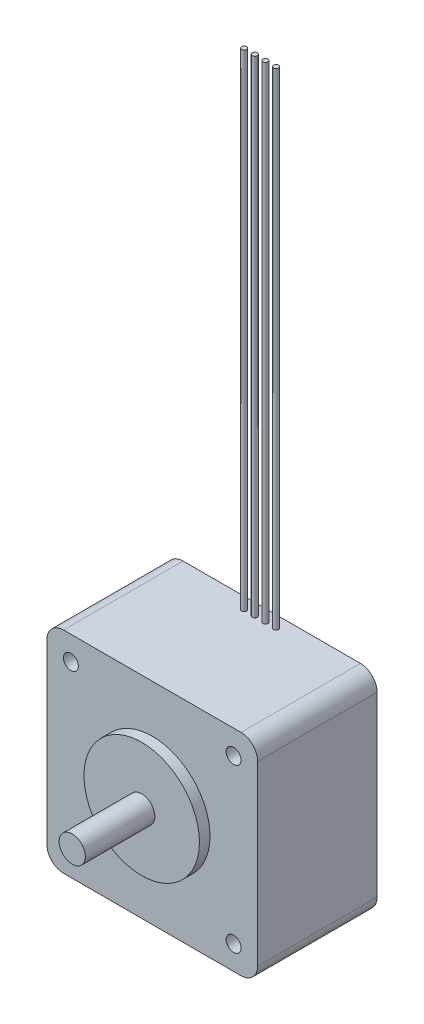
ISO-10303-21;
HEADER;
FILE_DESCRIPTION(('STEP AP214'),'2;1');
FILE_NAME('part.step','',(''),(''),'','','');
FILE_SCHEMA(('AUTOMOTIVE_DESIGN { 1 0 10303 214 1 1 1 1 }'));
ENDSEC;
DATA;
#1=APPLICATION_CONTEXT('core data for automotive mechanical design processes');
#2=APPLICATION_PROTOCOL_DEFINITION('international standard','automotive_design',2000,#1);
#3=PRODUCT_CONTEXT('',#1,'mechanical');
#4=PRODUCT('Part','Part','',(#3));
#5=PRODUCT_RELATED_PRODUCT_CATEGORY('part','',(#4));
#6=PRODUCT_DEFINITION_FORMATION('','',#4);
#7=PRODUCT_DEFINITION_CONTEXT('part definition',#1,'design');
#8=PRODUCT_DEFINITION('design','',#6,#7);
#9=PRODUCT_DEFINITION_SHAPE('','',#8);
#10=(LENGTH_UNIT() NAMED_UNIT(*) SI_UNIT(.MILLI.,.METRE.));
#11=(NAMED_UNIT(*) PLANE_ANGLE_UNIT() SI_UNIT($,.RADIAN.));
#12=(NAMED_UNIT(*) SI_UNIT($,.STERADIAN.) SOLID_ANGLE_UNIT());
#13=UNCERTAINTY_MEASURE_WITH_UNIT(LENGTH_MEASURE(1.E-05),#10,'distance_accuracy_value','');
#14=(GEOMETRIC_REPRESENTATION_CONTEXT(3) GLOBAL_UNCERTAINTY_ASSIGNED_CONTEXT((#13)) GLOBAL_UNIT_ASSIGNED_CONTEXT((#10,
#11,#12)) REPRESENTATION_CONTEXT('',''));
#15=CARTESIAN_POINT('',(0.,0.,0.));
#16=DIRECTION('',(0.,0.,1.));
#17=DIRECTION('',(1.,0.,0.));
#18=AXIS2_PLACEMENT_3D('',#15,#16,#17);
#19=CARTESIAN_POINT('',(-20.066,-20.066,0.));
#20=DIRECTION('',(0.,-1.,0.));
#21=DIRECTION('',(0.,0.,-1.));
#22=AXIS2_PLACEMENT_3D('',#19,#20,#21);
#23=PLANE('',#22);
#24=DIRECTION('',(1.,0.,0.));
#25=VECTOR('',#24,1.);
#26=CARTESIAN_POINT('',(-20.066,-20.066,22.7584));
#27=LINE('',#26,#25);
#28=CARTESIAN_POINT('',(-16.891,-20.066,22.7584));
#29=VERTEX_POINT('',#28);
#30=CARTESIAN_POINT('',(16.891,-20.066,22.7584));
#31=VERTEX_POINT('',#30);
#32=EDGE_CURVE('E94',#29,#31,#27,.T.);
#33=ORIENTED_EDGE('',*,*,#32,.F.);
#34=DIRECTION('',(0.,0.,1.));
#35=VECTOR('',#34,1.);
#36=CARTESIAN_POINT('',(-16.891,-20.066,0.));
#37=LINE('',#36,#35);
#38=CARTESIAN_POINT('',(-16.891,-20.066,0.));
#39=VERTEX_POINT('',#38);
#40=EDGE_CURVE('E133',#29,#39,#37,.F.);
#41=ORIENTED_EDGE('',*,*,#40,.T.);
#42=DIRECTION('',(1.,0.,0.));
#43=VECTOR('',#42,1.);
#44=CARTESIAN_POINT('',(-20.066,-20.066,0.));
#45=LINE('',#44,#43);
#46=CARTESIAN_POINT('',(16.891,-20.066,0.));
#47=VERTEX_POINT('',#46);
#48=EDGE_CURVE('E117',#39,#47,#45,.T.);
#49=ORIENTED_EDGE('',*,*,#48,.T.);
#50=DIRECTION('',(0.,0.,1.));
#51=VECTOR('',#50,1.);
#52=CARTESIAN_POINT('',(16.891,-20.066,0.));
#53=LINE('',#52,#51);
#54=EDGE_CURVE('E113',#47,#31,#53,.T.);
#55=ORIENTED_EDGE('',*,*,#54,.T.);
#56=EDGE_LOOP('',(#33,#41,#49,#55));
#57=FACE_BOUND('',#56,.T.);
#58=ADVANCED_FACE('F33',(#57),#23,.T.);
#59=CARTESIAN_POINT('',(-20.066,20.066,0.));
#60=DIRECTION('',(-1.,0.,0.));
#61=DIRECTION('',(0.,0.,1.));
#62=AXIS2_PLACEMENT_3D('',#59,#60,#61);
#63=PLANE('',#62);
#64=DIRECTION('',(0.,-1.,0.));
#65=VECTOR('',#64,1.);
#66=CARTESIAN_POINT('',(-20.066,20.066,22.7584));
#67=LINE('',#66,#65);
#68=CARTESIAN_POINT('',(-20.066,16.891,22.7584));
#69=VERTEX_POINT('',#68);
#70=CARTESIAN_POINT('',(-20.066,-16.891,22.7584));
#71=VERTEX_POINT('',#70);
#72=EDGE_CURVE('E161',#69,#71,#67,.T.);
#73=ORIENTED_EDGE('',*,*,#72,.F.);
#74=DIRECTION('',(0.,0.,1.));
#75=VECTOR('',#74,1.);
#76=CARTESIAN_POINT('',(-20.066,16.891,0.));
#77=LINE('',#76,#75);
#78=CARTESIAN_POINT('',(-20.066,16.891,0.));
#79=VERTEX_POINT('',#78);
#80=EDGE_CURVE('E41',#69,#79,#77,.F.);
#81=ORIENTED_EDGE('',*,*,#80,.T.);
#82=DIRECTION('',(0.,-1.,0.));
#83=VECTOR('',#82,1.);
#84=CARTESIAN_POINT('',(-20.066,20.066,0.));
#85=LINE('',#84,#83);
#86=CARTESIAN_POINT('',(-20.066,-16.891,0.));
#87=VERTEX_POINT('',#86);
#88=EDGE_CURVE('E170',#79,#87,#85,.T.);
#89=ORIENTED_EDGE('',*,*,#88,.T.);
#90=DIRECTION('',(0.,0.,1.));
#91=VECTOR('',#90,1.);
#92=CARTESIAN_POINT('',(-20.066,-16.891,0.));
#93=LINE('',#92,#91);
#94=EDGE_CURVE('E129',#87,#71,#93,.T.);
#95=ORIENTED_EDGE('',*,*,#94,.T.);
#96=EDGE_LOOP('',(#73,#81,#89,#95));
#97=FACE_BOUND('',#96,.T.);
#98=ADVANCED_FACE('F184',(#97),#63,.T.);
#99=CARTESIAN_POINT('',(20.066,20.066,0.));
#100=DIRECTION('',(0.,1.,0.));
#101=DIRECTION('',(0.,0.,1.));
#102=AXIS2_PLACEMENT_3D('',#99,#100,#101);
#103=PLANE('',#102);
#104=CARTESIAN_POINT('',(-1.01600000000001,20.066,2.2098));
#105=DIRECTION('',(0.,1.,0.));
#106=DIRECTION('',(0.,0.,1.));
#107=AXIS2_PLACEMENT_3D('',#104,#105,#106);
#108=CIRCLE('',#107,0.4826);
#109=CARTESIAN_POINT('',(-1.01600000000001,20.066,2.6924));
#110=VERTEX_POINT('',#109);
#111=EDGE_CURVE('E122',#110,#110,#108,.T.);
#112=ORIENTED_EDGE('',*,*,#111,.F.);
#113=EDGE_LOOP('',(#112));
#114=FACE_BOUND('',#113,.T.);
#115=CARTESIAN_POINT('',(3.04799999999999,20.066,2.2098));
#116=DIRECTION('',(0.,1.,0.));
#117=DIRECTION('',(0.,0.,1.));
#118=AXIS2_PLACEMENT_3D('',#115,#116,#117);
#119=CIRCLE('',#118,0.4826);
#120=CARTESIAN_POINT('',(3.04799999999999,20.066,2.6924));
#121=VERTEX_POINT('',#120);
#122=EDGE_CURVE('E173',#121,#121,#119,.T.);
#123=ORIENTED_EDGE('',*,*,#122,.F.);
#124=EDGE_LOOP('',(#123));
#125=FACE_BOUND('',#124,.T.);
#126=CARTESIAN_POINT('',(1.01599999999999,20.066,2.2098));
#127=DIRECTION('',(0.,1.,0.));
#128=DIRECTION('',(0.,0.,1.));
#129=AXIS2_PLACEMENT_3D('',#126,#127,#128);
#130=CIRCLE('',#129,0.482599999999999);
#131=CARTESIAN_POINT('',(1.01599999999999,20.066,2.6924));
#132=VERTEX_POINT('',#131);
#133=EDGE_CURVE('E169',#132,#132,#130,.T.);
#134=ORIENTED_EDGE('',*,*,#133,.F.);
#135=EDGE_LOOP('',(#134));
#136=FACE_BOUND('',#135,.T.);
#137=CARTESIAN_POINT('',(-3.04800000000001,20.066,2.2098));
#138=DIRECTION('',(0.,1.,0.));
#139=DIRECTION('',(0.,0.,1.));
#140=AXIS2_PLACEMENT_3D('',#137,#138,#139);
#141=CIRCLE('',#140,0.4826);
#142=CARTESIAN_POINT('',(-3.04800000000001,20.066,2.6924));
#143=VERTEX_POINT('',#142);
#144=EDGE_CURVE('E166',#143,#143,#141,.T.);
#145=ORIENTED_EDGE('',*,*,#144,.F.);
#146=EDGE_LOOP('',(#145));
#147=FACE_BOUND('',#146,.T.);
#148=DIRECTION('',(-1.,0.,0.));
#149=VECTOR('',#148,1.);
#150=CARTESIAN_POINT('',(20.066,20.066,0.));
#151=LINE('',#150,#149);
#152=CARTESIAN_POINT('',(16.891,20.066,0.));
#153=VERTEX_POINT('',#152);
#154=CARTESIAN_POINT('',(-16.891,20.066,0.));
#155=VERTEX_POINT('',#154);
#156=EDGE_CURVE('E158',#153,#155,#151,.T.);
#157=ORIENTED_EDGE('',*,*,#156,.T.);
#158=DIRECTION('',(0.,0.,1.));
#159=VECTOR('',#158,1.);
#160=CARTESIAN_POINT('',(-16.891,20.066,0.));
#161=LINE('',#160,#159);
#162=CARTESIAN_POINT('',(-16.891,20.066,22.7584));
#163=VERTEX_POINT('',#162);
#164=EDGE_CURVE('E147',#155,#163,#161,.T.);
#165=ORIENTED_EDGE('',*,*,#164,.T.);
#166=DIRECTION('',(-1.,0.,0.));
#167=VECTOR('',#166,1.);
#168=CARTESIAN_POINT('',(20.066,20.066,22.7584));
#169=LINE('',#168,#167);
#170=CARTESIAN_POINT('',(16.891,20.066,22.7584));
#171=VERTEX_POINT('',#170);
#172=EDGE_CURVE('E155',#171,#163,#169,.T.);
#173=ORIENTED_EDGE('',*,*,#172,.F.);
#174=DIRECTION('',(0.,0.,1.));
#175=VECTOR('',#174,1.);
#176=CARTESIAN_POINT('',(16.891,20.066,0.));
#177=LINE('',#176,#175);
#178=EDGE_CURVE('E143',#171,#153,#177,.F.);
#179=ORIENTED_EDGE('',*,*,#178,.T.);
#180=EDGE_LOOP('',(#157,#165,#173,#179));
#181=FACE_BOUND('',#180,.T.);
#182=ADVANCED_FACE('F154',(#114,#125,#136,#147,#181),#103,.T.);
#183=CARTESIAN_POINT('',(20.066,-20.066,0.));
#184=DIRECTION('',(1.,0.,0.));
#185=DIRECTION('',(0.,0.,-1.));
#186=AXIS2_PLACEMENT_3D('',#183,#184,#185);
#187=PLANE('',#186);
#188=DIRECTION('',(0.,1.,0.));
#189=VECTOR('',#188,1.);
#190=CARTESIAN_POINT('',(20.066,-20.066,0.));
#191=LINE('',#190,#189);
#192=CARTESIAN_POINT('',(20.066,-16.891,0.));
#193=VERTEX_POINT('',#192);
#194=CARTESIAN_POINT('',(20.066,16.891,0.));
#195=VERTEX_POINT('',#194);
#196=EDGE_CURVE('E208',#193,#195,#191,.T.);
#197=ORIENTED_EDGE('',*,*,#196,.T.);
#198=DIRECTION('',(0.,0.,1.));
#199=VECTOR('',#198,1.);
#200=CARTESIAN_POINT('',(20.066,16.891,0.));
#201=LINE('',#200,#199);
#202=CARTESIAN_POINT('',(20.066,16.891,22.7584));
#203=VERTEX_POINT('',#202);
#204=EDGE_CURVE('E138',#195,#203,#201,.T.);
#205=ORIENTED_EDGE('',*,*,#204,.T.);
#206=DIRECTION('',(0.,1.,0.));
#207=VECTOR('',#206,1.);
#208=CARTESIAN_POINT('',(20.066,-20.066,22.7584));
#209=LINE('',#208,#207);
#210=CARTESIAN_POINT('',(20.066,-16.891,22.7584));
#211=VERTEX_POINT('',#210);
#212=EDGE_CURVE('E105',#211,#203,#209,.T.);
#213=ORIENTED_EDGE('',*,*,#212,.F.);
#214=DIRECTION('',(0.,0.,1.));
#215=VECTOR('',#214,1.);
#216=CARTESIAN_POINT('',(20.066,-16.891,0.));
#217=LINE('',#216,#215);
#218=EDGE_CURVE('E114',#211,#193,#217,.F.);
#219=ORIENTED_EDGE('',*,*,#218,.T.);
#220=EDGE_LOOP('',(#197,#205,#213,#219));
#221=FACE_BOUND('',#220,.T.);
#222=ADVANCED_FACE('F183',(#221),#187,.T.);
#223=CARTESIAN_POINT('',(20.066,-20.066,0.));
#224=DIRECTION('',(0.,0.,1.));
#225=DIRECTION('',(1.,0.,0.));
#226=AXIS2_PLACEMENT_3D('',#223,#224,#225);
#227=PLANE('',#226);
#228=ORIENTED_EDGE('',*,*,#88,.F.);
#229=CARTESIAN_POINT('',(-16.891,16.891,0.));
#230=DIRECTION('',(0.,0.,1.));
#231=DIRECTION('',(1.,0.,0.));
#232=AXIS2_PLACEMENT_3D('',#229,#230,#231);
#233=CIRCLE('',#232,3.175);
#234=EDGE_CURVE('E11',#79,#155,#233,.F.);
#235=ORIENTED_EDGE('',*,*,#234,.T.);
#236=ORIENTED_EDGE('',*,*,#156,.F.);
#237=CARTESIAN_POINT('',(16.891,16.891,0.));
#238=DIRECTION('',(0.,0.,1.));
#239=DIRECTION('',(1.,0.,0.));
#240=AXIS2_PLACEMENT_3D('',#237,#238,#239);
#241=CIRCLE('',#240,3.175);
#242=EDGE_CURVE('E145',#153,#195,#241,.F.);
#243=ORIENTED_EDGE('',*,*,#242,.T.);
#244=ORIENTED_EDGE('',*,*,#196,.F.);
#245=CARTESIAN_POINT('',(16.891,-16.891,0.));
#246=DIRECTION('',(0.,0.,1.));
#247=DIRECTION('',(1.,0.,0.));
#248=AXIS2_PLACEMENT_3D('',#245,#246,#247);
#249=CIRCLE('',#248,3.175);
#250=EDGE_CURVE('E127',#193,#47,#249,.F.);
#251=ORIENTED_EDGE('',*,*,#250,.T.);
#252=ORIENTED_EDGE('',*,*,#48,.F.);
#253=CARTESIAN_POINT('',(-16.891,-16.891,0.));
#254=DIRECTION('',(0.,0.,1.));
#255=DIRECTION('',(1.,0.,0.));
#256=AXIS2_PLACEMENT_3D('',#253,#254,#255);
#257=CIRCLE('',#256,3.175);
#258=EDGE_CURVE('E135',#39,#87,#257,.F.);
#259=ORIENTED_EDGE('',*,*,#258,.T.);
#260=EDGE_LOOP('',(#228,#235,#236,#243,#244,#251,#252,#259));
#261=FACE_BOUND('',#260,.T.);
#262=ADVANCED_FACE('F215',(#261),#227,.F.);
#263=CARTESIAN_POINT('',(20.066,-20.066,22.7584));
#264=DIRECTION('',(0.,0.,1.));
#265=DIRECTION('',(1.,0.,0.));
#266=AXIS2_PLACEMENT_3D('',#263,#264,#265);
#267=PLANE('',#266);
#268=CARTESIAN_POINT('',(15.494,-15.494,22.7584));
#269=DIRECTION('',(0.,0.,1.));
#270=DIRECTION('',(1.,0.,0.));
#271=AXIS2_PLACEMENT_3D('',#268,#269,#270);
#272=CIRCLE('',#271,1.42240000000001);
#273=CARTESIAN_POINT('',(16.9164,-15.494,22.7584));
#274=VERTEX_POINT('',#273);
#275=EDGE_CURVE('E321',#274,#274,#272,.T.);
#276=ORIENTED_EDGE('',*,*,#275,.F.);
#277=EDGE_LOOP('',(#276));
#278=FACE_BOUND('',#277,.T.);
#279=CARTESIAN_POINT('',(-15.494,-15.494,22.7584));
#280=DIRECTION('',(0.,0.,1.));
#281=DIRECTION('',(1.,0.,0.));
#282=AXIS2_PLACEMENT_3D('',#279,#280,#281);
#283=CIRCLE('',#282,1.42240000000001);
#284=CARTESIAN_POINT('',(-14.0716,-15.494,22.7584));
#285=VERTEX_POINT('',#284);
#286=EDGE_CURVE('E323',#285,#285,#283,.T.);
#287=ORIENTED_EDGE('',*,*,#286,.F.);
#288=EDGE_LOOP('',(#287));
#289=FACE_BOUND('',#288,.T.);
#290=CARTESIAN_POINT('',(15.494,15.494,22.7584));
#291=DIRECTION('',(0.,0.,1.));
#292=DIRECTION('',(1.,0.,0.));
#293=AXIS2_PLACEMENT_3D('',#290,#291,#292);
#294=CIRCLE('',#293,1.42240000000001);
#295=CARTESIAN_POINT('',(16.9164,15.494,22.7584));
#296=VERTEX_POINT('',#295);
#297=EDGE_CURVE('E331',#296,#296,#294,.T.);
#298=ORIENTED_EDGE('',*,*,#297,.F.);
#299=EDGE_LOOP('',(#298));
#300=FACE_BOUND('',#299,.T.);
#301=CARTESIAN_POINT('',(-15.494,15.494,22.7584));
#302=DIRECTION('',(0.,0.,1.));
#303=DIRECTION('',(1.,0.,0.));
#304=AXIS2_PLACEMENT_3D('',#301,#302,#303);
#305=CIRCLE('',#304,1.42240000000001);
#306=CARTESIAN_POINT('',(-14.0716,15.494,22.7584));
#307=VERTEX_POINT('',#306);
#308=EDGE_CURVE('E337',#307,#307,#305,.T.);
#309=ORIENTED_EDGE('',*,*,#308,.F.);
#310=EDGE_LOOP('',(#309));
#311=FACE_BOUND('',#310,.T.);
#312=CARTESIAN_POINT('',(0.,0.,22.7584));
#313=DIRECTION('',(0.,0.,1.));
#314=DIRECTION('',(1.,0.,0.));
#315=AXIS2_PLACEMENT_3D('',#312,#313,#314);
#316=CIRCLE('',#315,10.9982);
#317=CARTESIAN_POINT('',(10.9982,0.,22.7584));
#318=VERTEX_POINT('',#317);
#319=EDGE_CURVE('E119',#318,#318,#316,.T.);
#320=ORIENTED_EDGE('',*,*,#319,.F.);
#321=EDGE_LOOP('',(#320));
#322=FACE_BOUND('',#321,.T.);
#323=ORIENTED_EDGE('',*,*,#172,.T.);
#324=CARTESIAN_POINT('',(-16.891,16.891,22.7584));
#325=DIRECTION('',(0.,0.,1.));
#326=DIRECTION('',(1.,0.,0.));
#327=AXIS2_PLACEMENT_3D('',#324,#325,#326);
#328=CIRCLE('',#327,3.175);
#329=EDGE_CURVE('E55',#163,#69,#328,.T.);
#330=ORIENTED_EDGE('',*,*,#329,.T.);
#331=ORIENTED_EDGE('',*,*,#72,.T.);
#332=CARTESIAN_POINT('',(-16.891,-16.891,22.7584));
#333=DIRECTION('',(0.,0.,1.));
#334=DIRECTION('',(1.,0.,0.));
#335=AXIS2_PLACEMENT_3D('',#332,#333,#334);
#336=CIRCLE('',#335,3.175);
#337=EDGE_CURVE('E101',#71,#29,#336,.T.);
#338=ORIENTED_EDGE('',*,*,#337,.T.);
#339=ORIENTED_EDGE('',*,*,#32,.T.);
#340=CARTESIAN_POINT('',(16.891,-16.891,22.7584));
#341=DIRECTION('',(0.,0.,1.));
#342=DIRECTION('',(1.,0.,0.));
#343=AXIS2_PLACEMENT_3D('',#340,#341,#342);
#344=CIRCLE('',#343,3.175);
#345=EDGE_CURVE('E98',#31,#211,#344,.T.);
#346=ORIENTED_EDGE('',*,*,#345,.T.);
#347=ORIENTED_EDGE('',*,*,#212,.T.);
#348=CARTESIAN_POINT('',(16.891,16.891,22.7584));
#349=DIRECTION('',(0.,0.,1.));
#350=DIRECTION('',(1.,0.,0.));
#351=AXIS2_PLACEMENT_3D('',#348,#349,#350);
#352=CIRCLE('',#351,3.175);
#353=EDGE_CURVE('E141',#203,#171,#352,.T.);
#354=ORIENTED_EDGE('',*,*,#353,.T.);
#355=EDGE_LOOP('',(#323,#330,#331,#338,#339,#346,#347,#354));
#356=FACE_BOUND('',#355,.T.);
#357=ADVANCED_FACE('F96',(#278,#289,#300,#311,#322,#356),#267,.T.);
#358=CARTESIAN_POINT('',(-3.04800000000001,20.066,2.2098));
#359=DIRECTION('',(0.,1.,0.));
#360=DIRECTION('',(-1.,0.,0.));
#361=AXIS2_PLACEMENT_3D('',#358,#359,#360);
#362=CYLINDRICAL_SURFACE('',#361,0.4826);
#363=ORIENTED_EDGE('',*,*,#144,.T.);
#364=EDGE_LOOP('',(#363));
#365=FACE_BOUND('',#364,.T.);
#366=CARTESIAN_POINT('',(-3.0480000000001,112.685583510966,2.2098));
#367=DIRECTION('',(0.,1.,0.));
#368=DIRECTION('',(-1.,0.,0.));
#369=AXIS2_PLACEMENT_3D('',#366,#367,#368);
#370=CIRCLE('',#369,0.4826);
#371=CARTESIAN_POINT('',(-3.5306000000001,112.685583510966,2.2098));
#372=VERTEX_POINT('',#371);
#373=EDGE_CURVE('E106',#372,#372,#370,.T.);
#374=ORIENTED_EDGE('',*,*,#373,.F.);
#375=EDGE_LOOP('',(#374));
#376=FACE_BOUND('',#375,.T.);
#377=ADVANCED_FACE('F192',(#365,#376),#362,.T.);
#378=CARTESIAN_POINT('',(-3.0480000000001,112.685583510966,2.2098));
#379=DIRECTION('',(0.,1.,0.));
#380=DIRECTION('',(-1.,0.,0.));
#381=AXIS2_PLACEMENT_3D('',#378,#379,#380);
#382=PLANE('',#381);
#383=ORIENTED_EDGE('',*,*,#373,.T.);
#384=EDGE_LOOP('',(#383));
#385=FACE_BOUND('',#384,.T.);
#386=ADVANCED_FACE('F195',(#385),#382,.T.);
#387=CARTESIAN_POINT('',(1.01599999999999,20.066,2.2098));
#388=DIRECTION('',(0.,1.,0.));
#389=DIRECTION('',(-1.,0.,0.));
#390=AXIS2_PLACEMENT_3D('',#387,#388,#389);
#391=CYLINDRICAL_SURFACE('',#390,0.482599999999999);
#392=ORIENTED_EDGE('',*,*,#133,.T.);
#393=EDGE_LOOP('',(#392));
#394=FACE_BOUND('',#393,.T.);
#395=CARTESIAN_POINT('',(1.0159999999999,112.685583510966,2.2098));
#396=DIRECTION('',(0.,1.,0.));
#397=DIRECTION('',(-1.,0.,0.));
#398=AXIS2_PLACEMENT_3D('',#395,#396,#397);
#399=CIRCLE('',#398,0.4826);
#400=CARTESIAN_POINT('',(0.533399999999898,112.685583510966,2.2098));
#401=VERTEX_POINT('',#400);
#402=EDGE_CURVE('E200',#401,#401,#399,.T.);
#403=ORIENTED_EDGE('',*,*,#402,.F.);
#404=EDGE_LOOP('',(#403));
#405=FACE_BOUND('',#404,.T.);
#406=ADVANCED_FACE('F245',(#394,#405),#391,.T.);
#407=CARTESIAN_POINT('',(1.0159999999999,112.685583510966,2.2098));
#408=DIRECTION('',(0.,1.,0.));
#409=DIRECTION('',(-1.,0.,0.));
#410=AXIS2_PLACEMENT_3D('',#407,#408,#409);
#411=PLANE('',#410);
#412=ORIENTED_EDGE('',*,*,#402,.T.);
#413=EDGE_LOOP('',(#412));
#414=FACE_BOUND('',#413,.T.);
#415=ADVANCED_FACE('F248',(#414),#411,.T.);
#416=CARTESIAN_POINT('',(3.04799999999999,20.066,2.2098));
#417=DIRECTION('',(0.,1.,0.));
#418=DIRECTION('',(-1.,0.,0.));
#419=AXIS2_PLACEMENT_3D('',#416,#417,#418);
#420=CYLINDRICAL_SURFACE('',#419,0.4826);
#421=ORIENTED_EDGE('',*,*,#122,.T.);
#422=EDGE_LOOP('',(#421));
#423=FACE_BOUND('',#422,.T.);
#424=CARTESIAN_POINT('',(3.0479999999999,112.685583510966,2.2098));
#425=DIRECTION('',(0.,1.,0.));
#426=DIRECTION('',(-1.,0.,0.));
#427=AXIS2_PLACEMENT_3D('',#424,#425,#426);
#428=CIRCLE('',#427,0.4826);
#429=CARTESIAN_POINT('',(2.5653999999999,112.685583510966,2.2098));
#430=VERTEX_POINT('',#429);
#431=EDGE_CURVE('E203',#430,#430,#428,.T.);
#432=ORIENTED_EDGE('',*,*,#431,.F.);
#433=EDGE_LOOP('',(#432));
#434=FACE_BOUND('',#433,.T.);
#435=ADVANCED_FACE('F252',(#423,#434),#420,.T.);
#436=CARTESIAN_POINT('',(3.0479999999999,112.685583510966,2.2098));
#437=DIRECTION('',(0.,1.,0.));
#438=DIRECTION('',(-1.,0.,0.));
#439=AXIS2_PLACEMENT_3D('',#436,#437,#438);
#440=PLANE('',#439);
#441=ORIENTED_EDGE('',*,*,#431,.T.);
#442=EDGE_LOOP('',(#441));
#443=FACE_BOUND('',#442,.T.);
#444=ADVANCED_FACE('F256',(#443),#440,.T.);
#445=CARTESIAN_POINT('',(-1.01600000000001,20.066,2.2098));
#446=DIRECTION('',(0.,1.,0.));
#447=DIRECTION('',(-1.,0.,0.));
#448=AXIS2_PLACEMENT_3D('',#445,#446,#447);
#449=CYLINDRICAL_SURFACE('',#448,0.4826);
#450=ORIENTED_EDGE('',*,*,#111,.T.);
#451=EDGE_LOOP('',(#450));
#452=FACE_BOUND('',#451,.T.);
#453=CARTESIAN_POINT('',(-1.0160000000001,112.685583510966,2.2098));
#454=DIRECTION('',(0.,1.,0.));
#455=DIRECTION('',(-1.,0.,0.));
#456=AXIS2_PLACEMENT_3D('',#453,#454,#455);
#457=CIRCLE('',#456,0.4826);
#458=CARTESIAN_POINT('',(-1.4986000000001,112.685583510966,2.2098));
#459=VERTEX_POINT('',#458);
#460=EDGE_CURVE('E352',#459,#459,#457,.T.);
#461=ORIENTED_EDGE('',*,*,#460,.F.);
#462=EDGE_LOOP('',(#461));
#463=FACE_BOUND('',#462,.T.);
#464=ADVANCED_FACE('F178',(#452,#463),#449,.T.);
#465=CARTESIAN_POINT('',(-1.0160000000001,112.685583510966,2.2098));
#466=DIRECTION('',(0.,1.,0.));
#467=DIRECTION('',(-1.,0.,0.));
#468=AXIS2_PLACEMENT_3D('',#465,#466,#467);
#469=PLANE('',#468);
#470=ORIENTED_EDGE('',*,*,#460,.T.);
#471=EDGE_LOOP('',(#470));
#472=FACE_BOUND('',#471,.T.);
#473=ADVANCED_FACE('F263',(#472),#469,.T.);
#474=CARTESIAN_POINT('',(0.,0.,22.7584));
#475=DIRECTION('',(0.,0.,1.));
#476=DIRECTION('',(1.,0.,0.));
#477=AXIS2_PLACEMENT_3D('',#474,#475,#476);
#478=CYLINDRICAL_SURFACE('',#477,10.9982);
#479=ORIENTED_EDGE('',*,*,#319,.T.);
#480=EDGE_LOOP('',(#479));
#481=FACE_BOUND('',#480,.T.);
#482=CARTESIAN_POINT('',(0.,0.,24.765));
#483=DIRECTION('',(0.,0.,1.));
#484=DIRECTION('',(1.,0.,0.));
#485=AXIS2_PLACEMENT_3D('',#482,#483,#484);
#486=CIRCLE('',#485,10.9982);
#487=CARTESIAN_POINT('',(10.9982,0.,24.765));
#488=VERTEX_POINT('',#487);
#489=EDGE_CURVE('E343',#488,#488,#486,.T.);
#490=ORIENTED_EDGE('',*,*,#489,.F.);
#491=EDGE_LOOP('',(#490));
#492=FACE_BOUND('',#491,.T.);
#493=ADVANCED_FACE('F266',(#481,#492),#478,.T.);
#494=CARTESIAN_POINT('',(0.,0.,37.9984));
#495=DIRECTION('',(0.,0.,1.));
#496=DIRECTION('',(1.,0.,0.));
#497=AXIS2_PLACEMENT_3D('',#494,#495,#496);
#498=PLANE('',#497);
#499=CARTESIAN_POINT('',(0.,0.,37.9984));
#500=DIRECTION('',(0.,0.,1.));
#501=DIRECTION('',(1.,0.,0.));
#502=AXIS2_PLACEMENT_3D('',#499,#500,#501);
#503=CIRCLE('',#502,2.49936);
#504=CARTESIAN_POINT('',(2.49936,0.,37.9984));
#505=VERTEX_POINT('',#504);
#506=EDGE_CURVE('E349',#505,#505,#503,.T.);
#507=ORIENTED_EDGE('',*,*,#506,.T.);
#508=EDGE_LOOP('',(#507));
#509=FACE_BOUND('',#508,.T.);
#510=ADVANCED_FACE('F270',(#509),#498,.T.);
#511=CARTESIAN_POINT('',(0.,0.,22.7584));
#512=DIRECTION('',(0.,0.,1.));
#513=DIRECTION('',(1.,0.,0.));
#514=AXIS2_PLACEMENT_3D('',#511,#512,#513);
#515=CYLINDRICAL_SURFACE('',#514,2.49936);
#516=CARTESIAN_POINT('',(0.,0.,24.765));
#517=DIRECTION('',(0.,0.,1.));
#518=DIRECTION('',(1.,0.,0.));
#519=AXIS2_PLACEMENT_3D('',#516,#517,#518);
#520=CIRCLE('',#519,2.49936);
#521=CARTESIAN_POINT('',(2.49936,0.,24.765));
#522=VERTEX_POINT('',#521);
#523=EDGE_CURVE('E346',#522,#522,#520,.T.);
#524=ORIENTED_EDGE('',*,*,#523,.T.);
#525=EDGE_LOOP('',(#524));
#526=FACE_BOUND('',#525,.T.);
#527=ORIENTED_EDGE('',*,*,#506,.F.);
#528=EDGE_LOOP('',(#527));
#529=FACE_BOUND('',#528,.T.);
#530=ADVANCED_FACE('F274',(#526,#529),#515,.T.);
#531=CARTESIAN_POINT('',(2.49936,0.,24.765));
#532=DIRECTION('',(0.,0.,1.));
#533=DIRECTION('',(1.,0.,0.));
#534=AXIS2_PLACEMENT_3D('',#531,#532,#533);
#535=PLANE('',#534);
#536=ORIENTED_EDGE('',*,*,#489,.T.);
#537=EDGE_LOOP('',(#536));
#538=FACE_BOUND('',#537,.T.);
#539=ORIENTED_EDGE('',*,*,#523,.F.);
#540=EDGE_LOOP('',(#539));
#541=FACE_BOUND('',#540,.T.);
#542=ADVANCED_FACE('F278',(#538,#541),#535,.T.);
#543=CARTESIAN_POINT('',(-15.494,15.494,0.762000000000002));
#544=DIRECTION('',(0.,0.,-1.));
#545=DIRECTION('',(-1.,0.,0.));
#546=AXIS2_PLACEMENT_3D('',#543,#544,#545);
#547=PLANE('',#546);
#548=CARTESIAN_POINT('',(-15.494,15.494,0.762000000000002));
#549=DIRECTION('',(0.,0.,1.));
#550=DIRECTION('',(1.,0.,0.));
#551=AXIS2_PLACEMENT_3D('',#548,#549,#550);
#552=CIRCLE('',#551,1.42240000000001);
#553=CARTESIAN_POINT('',(-14.0716,15.494,0.762000000000002));
#554=VERTEX_POINT('',#553);
#555=EDGE_CURVE('E340',#554,#554,#552,.T.);
#556=ORIENTED_EDGE('',*,*,#555,.T.);
#557=EDGE_LOOP('',(#556));
#558=FACE_BOUND('',#557,.T.);
#559=ADVANCED_FACE('F282',(#558),#547,.F.);
#560=CARTESIAN_POINT('',(-15.494,15.494,22.7584));
#561=DIRECTION('',(0.,0.,1.));
#562=DIRECTION('',(1.,0.,0.));
#563=AXIS2_PLACEMENT_3D('',#560,#561,#562);
#564=CYLINDRICAL_SURFACE('',#563,1.42240000000001);
#565=ORIENTED_EDGE('',*,*,#555,.F.);
#566=EDGE_LOOP('',(#565));
#567=FACE_BOUND('',#566,.T.);
#568=ORIENTED_EDGE('',*,*,#308,.T.);
#569=EDGE_LOOP('',(#568));
#570=FACE_BOUND('',#569,.T.);
#571=ADVANCED_FACE('F286',(#567,#570),#564,.F.);
#572=CARTESIAN_POINT('',(15.494,15.494,0.762000000000002));
#573=DIRECTION('',(0.,0.,-1.));
#574=DIRECTION('',(-1.,0.,0.));
#575=AXIS2_PLACEMENT_3D('',#572,#573,#574);
#576=PLANE('',#575);
#577=CARTESIAN_POINT('',(15.494,15.494,0.762000000000002));
#578=DIRECTION('',(0.,0.,1.));
#579=DIRECTION('',(1.,0.,0.));
#580=AXIS2_PLACEMENT_3D('',#577,#578,#579);
#581=CIRCLE('',#580,1.42240000000001);
#582=CARTESIAN_POINT('',(16.9164,15.494,0.762000000000002));
#583=VERTEX_POINT('',#582);
#584=EDGE_CURVE('E334',#583,#583,#581,.T.);
#585=ORIENTED_EDGE('',*,*,#584,.T.);
#586=EDGE_LOOP('',(#585));
#587=FACE_BOUND('',#586,.T.);
#588=ADVANCED_FACE('F290',(#587),#576,.F.);
#589=CARTESIAN_POINT('',(15.494,15.494,22.7584));
#590=DIRECTION('',(0.,0.,1.));
#591=DIRECTION('',(1.,0.,0.));
#592=AXIS2_PLACEMENT_3D('',#589,#590,#591);
#593=CYLINDRICAL_SURFACE('',#592,1.42240000000001);
#594=ORIENTED_EDGE('',*,*,#584,.F.);
#595=EDGE_LOOP('',(#594));
#596=FACE_BOUND('',#595,.T.);
#597=ORIENTED_EDGE('',*,*,#297,.T.);
#598=EDGE_LOOP('',(#597));
#599=FACE_BOUND('',#598,.T.);
#600=ADVANCED_FACE('F294',(#596,#599),#593,.F.);
#601=CARTESIAN_POINT('',(-15.494,-15.494,0.762000000000002));
#602=DIRECTION('',(0.,0.,-1.));
#603=DIRECTION('',(-1.,0.,0.));
#604=AXIS2_PLACEMENT_3D('',#601,#602,#603);
#605=PLANE('',#604);
#606=CARTESIAN_POINT('',(-15.494,-15.494,0.762000000000002));
#607=DIRECTION('',(0.,0.,1.));
#608=DIRECTION('',(1.,0.,0.));
#609=AXIS2_PLACEMENT_3D('',#606,#607,#608);
#610=CIRCLE('',#609,1.42240000000001);
#611=CARTESIAN_POINT('',(-14.0716,-15.494,0.762000000000002));
#612=VERTEX_POINT('',#611);
#613=EDGE_CURVE('E328',#612,#612,#610,.T.);
#614=ORIENTED_EDGE('',*,*,#613,.T.);
#615=EDGE_LOOP('',(#614));
#616=FACE_BOUND('',#615,.T.);
#617=ADVANCED_FACE('F298',(#616),#605,.F.);
#618=CARTESIAN_POINT('',(-15.494,-15.494,22.7584));
#619=DIRECTION('',(0.,0.,1.));
#620=DIRECTION('',(1.,0.,0.));
#621=AXIS2_PLACEMENT_3D('',#618,#619,#620);
#622=CYLINDRICAL_SURFACE('',#621,1.42240000000001);
#623=ORIENTED_EDGE('',*,*,#613,.F.);
#624=EDGE_LOOP('',(#623));
#625=FACE_BOUND('',#624,.T.);
#626=ORIENTED_EDGE('',*,*,#286,.T.);
#627=EDGE_LOOP('',(#626));
#628=FACE_BOUND('',#627,.T.);
#629=ADVANCED_FACE('F302',(#625,#628),#622,.F.);
#630=CARTESIAN_POINT('',(15.494,-15.494,0.762000000000002));
#631=DIRECTION('',(0.,0.,-1.));
#632=DIRECTION('',(-1.,0.,0.));
#633=AXIS2_PLACEMENT_3D('',#630,#631,#632);
#634=PLANE('',#633);
#635=CARTESIAN_POINT('',(15.494,-15.494,0.762000000000002));
#636=DIRECTION('',(0.,0.,1.));
#637=DIRECTION('',(1.,0.,0.));
#638=AXIS2_PLACEMENT_3D('',#635,#636,#637);
#639=CIRCLE('',#638,1.42240000000001);
#640=CARTESIAN_POINT('',(16.9164,-15.494,0.762000000000002));
#641=VERTEX_POINT('',#640);
#642=EDGE_CURVE('E318',#641,#641,#639,.T.);
#643=ORIENTED_EDGE('',*,*,#642,.T.);
#644=EDGE_LOOP('',(#643));
#645=FACE_BOUND('',#644,.T.);
#646=ADVANCED_FACE('F306',(#645),#634,.F.);
#647=CARTESIAN_POINT('',(15.494,-15.494,22.7584));
#648=DIRECTION('',(0.,0.,1.));
#649=DIRECTION('',(1.,0.,0.));
#650=AXIS2_PLACEMENT_3D('',#647,#648,#649);
#651=CYLINDRICAL_SURFACE('',#650,1.42240000000001);
#652=ORIENTED_EDGE('',*,*,#642,.F.);
#653=EDGE_LOOP('',(#652));
#654=FACE_BOUND('',#653,.T.);
#655=ORIENTED_EDGE('',*,*,#275,.T.);
#656=EDGE_LOOP('',(#655));
#657=FACE_BOUND('',#656,.T.);
#658=ADVANCED_FACE('F226',(#654,#657),#651,.F.);
#659=CARTESIAN_POINT('',(16.891,-16.891,0.));
#660=DIRECTION('',(0.,0.,1.));
#661=DIRECTION('',(1.,0.,0.));
#662=AXIS2_PLACEMENT_3D('',#659,#660,#661);
#663=CYLINDRICAL_SURFACE('',#662,3.175);
#664=ORIENTED_EDGE('',*,*,#250,.F.);
#665=ORIENTED_EDGE('',*,*,#218,.F.);
#666=ORIENTED_EDGE('',*,*,#345,.F.);
#667=ORIENTED_EDGE('',*,*,#54,.F.);
#668=EDGE_LOOP('',(#664,#665,#666,#667));
#669=FACE_BOUND('',#668,.T.);
#670=ADVANCED_FACE('F112',(#669),#663,.T.);
#671=CARTESIAN_POINT('',(-16.891,-16.891,0.));
#672=DIRECTION('',(0.,0.,1.));
#673=DIRECTION('',(1.,0.,0.));
#674=AXIS2_PLACEMENT_3D('',#671,#672,#673);
#675=CYLINDRICAL_SURFACE('',#674,3.175);
#676=ORIENTED_EDGE('',*,*,#258,.F.);
#677=ORIENTED_EDGE('',*,*,#40,.F.);
#678=ORIENTED_EDGE('',*,*,#337,.F.);
#679=ORIENTED_EDGE('',*,*,#94,.F.);
#680=EDGE_LOOP('',(#676,#677,#678,#679));
#681=FACE_BOUND('',#680,.T.);
#682=ADVANCED_FACE('F217',(#681),#675,.T.);
#683=CARTESIAN_POINT('',(16.891,16.891,0.));
#684=DIRECTION('',(0.,0.,1.));
#685=DIRECTION('',(1.,0.,0.));
#686=AXIS2_PLACEMENT_3D('',#683,#684,#685);
#687=CYLINDRICAL_SURFACE('',#686,3.175);
#688=ORIENTED_EDGE('',*,*,#242,.F.);
#689=ORIENTED_EDGE('',*,*,#178,.F.);
#690=ORIENTED_EDGE('',*,*,#353,.F.);
#691=ORIENTED_EDGE('',*,*,#204,.F.);
#692=EDGE_LOOP('',(#688,#689,#690,#691));
#693=FACE_BOUND('',#692,.T.);
#694=ADVANCED_FACE('F219',(#693),#687,.T.);
#695=CARTESIAN_POINT('',(-16.891,16.891,0.));
#696=DIRECTION('',(0.,0.,1.));
#697=DIRECTION('',(1.,0.,0.));
#698=AXIS2_PLACEMENT_3D('',#695,#696,#697);
#699=CYLINDRICAL_SURFACE('',#698,3.175);
#700=ORIENTED_EDGE('',*,*,#234,.F.);
#701=ORIENTED_EDGE('',*,*,#80,.F.);
#702=ORIENTED_EDGE('',*,*,#329,.F.);
#703=ORIENTED_EDGE('',*,*,#164,.F.);
#704=EDGE_LOOP('',(#700,#701,#702,#703));
#705=FACE_BOUND('',#704,.T.);
#706=ADVANCED_FACE('F35',(#705),#699,.T.);
#707=CLOSED_SHELL('',(#58,#98,#182,#222,#262,#357,#377,#386,#406,#415,#435,#444,#464,#473,#493,
#510,#530,#542,#559,#571,#588,#600,#617,#629,#646,#658,#670,#682,#694,#706));
#708=MANIFOLD_SOLID_BREP('B2',#707);
#709=ADVANCED_BREP_SHAPE_REPRESENTATION('',(#18,#708),#14);
#710=SHAPE_DEFINITION_REPRESENTATION(#9,#709);
ENDSEC;
END-ISO-10303-21;
